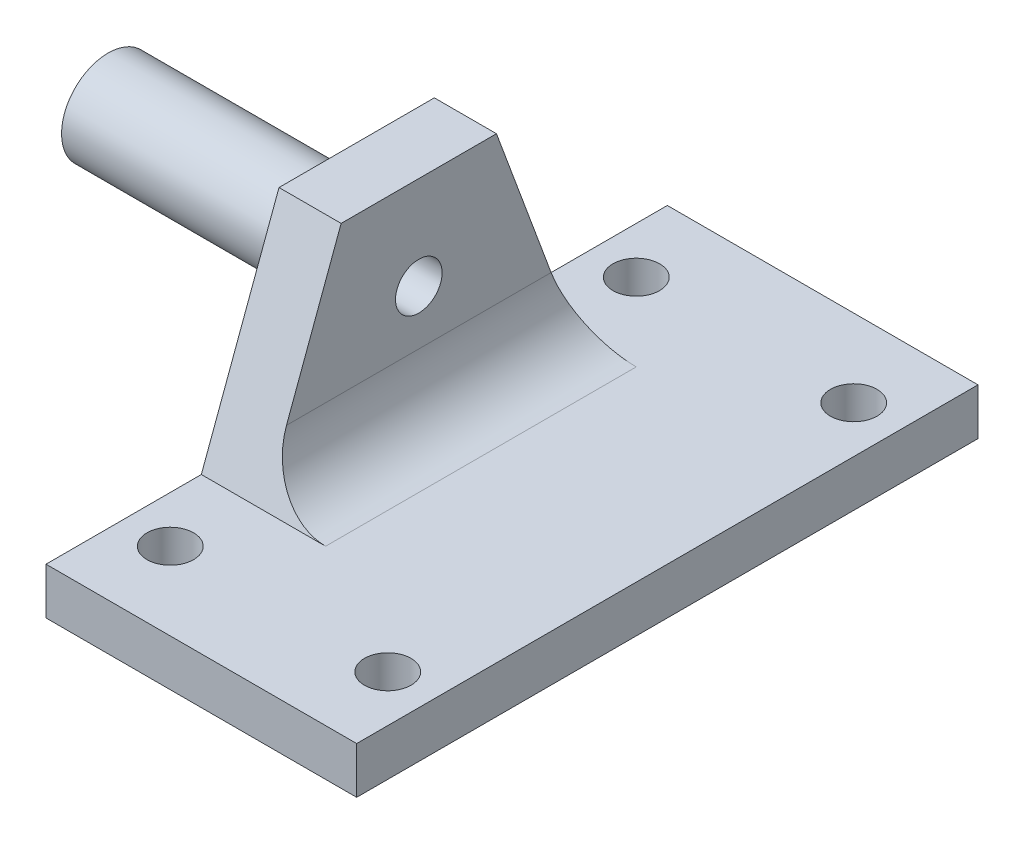
ISO-10303-21;
HEADER;
FILE_DESCRIPTION(('STEP AP214'),'2;1');
FILE_NAME('part.step','',(''),(''),'','','');
FILE_SCHEMA(('AUTOMOTIVE_DESIGN { 1 0 10303 214 1 1 1 1 }'));
ENDSEC;
DATA;
#1=APPLICATION_CONTEXT('core data for automotive mechanical design processes');
#2=APPLICATION_PROTOCOL_DEFINITION('international standard','automotive_design',2000,#1);
#3=PRODUCT_CONTEXT('',#1,'mechanical');
#4=PRODUCT('Part','Part','',(#3));
#5=PRODUCT_RELATED_PRODUCT_CATEGORY('part','',(#4));
#6=PRODUCT_DEFINITION_FORMATION('','',#4);
#7=PRODUCT_DEFINITION_CONTEXT('part definition',#1,'design');
#8=PRODUCT_DEFINITION('design','',#6,#7);
#9=PRODUCT_DEFINITION_SHAPE('','',#8);
#10=(LENGTH_UNIT() NAMED_UNIT(*) SI_UNIT(.MILLI.,.METRE.));
#11=(NAMED_UNIT(*) PLANE_ANGLE_UNIT() SI_UNIT($,.RADIAN.));
#12=(NAMED_UNIT(*) SI_UNIT($,.STERADIAN.) SOLID_ANGLE_UNIT());
#13=UNCERTAINTY_MEASURE_WITH_UNIT(LENGTH_MEASURE(1.E-05),#10,'distance_accuracy_value','');
#14=(GEOMETRIC_REPRESENTATION_CONTEXT(3) GLOBAL_UNCERTAINTY_ASSIGNED_CONTEXT((#13)) GLOBAL_UNIT_ASSIGNED_CONTEXT((#10,
#11,#12)) REPRESENTATION_CONTEXT('',''));
#15=CARTESIAN_POINT('',(0.,0.,0.));
#16=DIRECTION('',(0.,0.,1.));
#17=DIRECTION('',(1.,0.,0.));
#18=AXIS2_PLACEMENT_3D('',#15,#16,#17);
#19=CARTESIAN_POINT('',(4.,0.,0.));
#20=DIRECTION('',(1.,0.,0.));
#21=DIRECTION('',(0.,0.,-1.));
#22=AXIS2_PLACEMENT_3D('',#19,#20,#21);
#23=PLANE('',#22);
#24=CARTESIAN_POINT('',(4.,8.99999999999999,0.));
#25=DIRECTION('',(1.,0.,0.));
#26=DIRECTION('',(0.,0.,-1.));
#27=AXIS2_PLACEMENT_3D('',#24,#25,#26);
#28=CIRCLE('',#27,1.5);
#29=CARTESIAN_POINT('',(4.,8.99999999999999,-1.5));
#30=VERTEX_POINT('',#29);
#31=EDGE_CURVE('E133',#30,#30,#28,.T.);
#32=ORIENTED_EDGE('',*,*,#31,.F.);
#33=EDGE_LOOP('',(#32));
#34=FACE_BOUND('',#33,.T.);
#35=DIRECTION('',(0.,0.937748760723704,-0.347314355823594));
#36=VECTOR('',#35,1.);
#37=CARTESIAN_POINT('',(4.,3.43787696019301,9.28226779252111));
#38=LINE('',#37,#36);
#39=CARTESIAN_POINT('',(4.,5.49999999999999,8.51851851851853));
#40=VERTEX_POINT('',#39);
#41=CARTESIAN_POINT('',(4.,15.,5.));
#42=VERTEX_POINT('',#41);
#43=EDGE_CURVE('E141',#40,#42,#38,.T.);
#44=ORIENTED_EDGE('',*,*,#43,.F.);
#45=DIRECTION('',(0.,0.,-1.));
#46=VECTOR('',#45,1.);
#47=CARTESIAN_POINT('',(4.,5.49999999999999,-10.));
#48=LINE('',#47,#46);
#49=CARTESIAN_POINT('',(4.,5.49999999999999,-8.51851851851853));
#50=VERTEX_POINT('',#49);
#51=EDGE_CURVE('E176',#40,#50,#48,.T.);
#52=ORIENTED_EDGE('',*,*,#51,.T.);
#53=DIRECTION('',(0.,0.937748760723704,0.347314355823594));
#54=VECTOR('',#53,1.);
#55=CARTESIAN_POINT('',(4.,3.43787696019301,-9.28226779252111));
#56=LINE('',#55,#54);
#57=CARTESIAN_POINT('',(4.,15.,-5.));
#58=VERTEX_POINT('',#57);
#59=EDGE_CURVE('E143',#50,#58,#56,.T.);
#60=ORIENTED_EDGE('',*,*,#59,.T.);
#61=DIRECTION('',(0.,0.,-1.));
#62=VECTOR('',#61,1.);
#63=CARTESIAN_POINT('',(4.,15.,0.));
#64=LINE('',#63,#62);
#65=EDGE_CURVE('E146',#42,#58,#64,.T.);
#66=ORIENTED_EDGE('',*,*,#65,.F.);
#67=EDGE_LOOP('',(#44,#52,#60,#66));
#68=FACE_BOUND('',#67,.T.);
#69=ADVANCED_FACE('F35',(#34,#68),#23,.T.);
#70=CARTESIAN_POINT('',(4.,3.43787696019301,9.28226779252111));
#71=DIRECTION('',(0.,0.347314355823594,0.937748760723704));
#72=DIRECTION('',(0.,-0.937748760723704,0.347314355823594));
#73=AXIS2_PLACEMENT_3D('',#70,#71,#72);
#74=PLANE('',#73);
#75=DIRECTION('',(0.,0.937748760723704,-0.347314355823594));
#76=VECTOR('',#75,1.);
#77=CARTESIAN_POINT('',(0.,3.43787696019301,9.28226779252111));
#78=LINE('',#77,#76);
#79=CARTESIAN_POINT('',(0.,1.5,10.));
#80=VERTEX_POINT('',#79);
#81=CARTESIAN_POINT('',(0.,15.,5.));
#82=VERTEX_POINT('',#81);
#83=EDGE_CURVE('E140',#80,#82,#78,.T.);
#84=ORIENTED_EDGE('',*,*,#83,.F.);
#85=DIRECTION('',(-1.,0.,0.));
#86=VECTOR('',#85,1.);
#87=CARTESIAN_POINT('',(4.,1.5,10.));
#88=LINE('',#87,#86);
#89=CARTESIAN_POINT('',(8.,1.5,10.));
#90=VERTEX_POINT('',#89);
#91=EDGE_CURVE('E58',#90,#80,#88,.T.);
#92=ORIENTED_EDGE('',*,*,#91,.F.);
#93=CARTESIAN_POINT('',(8.,5.49999999999999,8.51851851851853));
#94=DIRECTION('',(0.,0.347314355823594,0.937748760723704));
#95=DIRECTION('',(0.,-0.937748760723704,0.347314355823594));
#96=AXIS2_PLACEMENT_3D('',#93,#94,#95);
#97=ELLIPSE('',#96,4.26553482930014,4.);
#98=EDGE_CURVE('E183',#90,#40,#97,.F.);
#99=ORIENTED_EDGE('',*,*,#98,.T.);
#100=ORIENTED_EDGE('',*,*,#43,.T.);
#101=DIRECTION('',(-1.,0.,0.));
#102=VECTOR('',#101,1.);
#103=CARTESIAN_POINT('',(4.,15.,5.));
#104=LINE('',#103,#102);
#105=EDGE_CURVE('E149',#42,#82,#104,.T.);
#106=ORIENTED_EDGE('',*,*,#105,.T.);
#107=EDGE_LOOP('',(#84,#92,#99,#100,#106));
#108=FACE_BOUND('',#107,.T.);
#109=ADVANCED_FACE('F200',(#108),#74,.T.);
#110=CARTESIAN_POINT('',(4.,0.,20.));
#111=DIRECTION('',(0.,0.,1.));
#112=DIRECTION('',(1.,0.,0.));
#113=AXIS2_PLACEMENT_3D('',#110,#111,#112);
#114=PLANE('',#113);
#115=DIRECTION('',(0.,1.,0.));
#116=VECTOR('',#115,1.);
#117=CARTESIAN_POINT('',(0.,0.,20.));
#118=LINE('',#117,#116);
#119=CARTESIAN_POINT('',(0.,-1.49999999999999,20.));
#120=VERTEX_POINT('',#119);
#121=CARTESIAN_POINT('',(0.,1.49999999999999,20.));
#122=VERTEX_POINT('',#121);
#123=EDGE_CURVE('E155',#120,#122,#118,.T.);
#124=ORIENTED_EDGE('',*,*,#123,.F.);
#125=DIRECTION('',(-1.,0.,0.));
#126=VECTOR('',#125,1.);
#127=CARTESIAN_POINT('',(4.,-1.49999999999999,20.));
#128=LINE('',#127,#126);
#129=CARTESIAN_POINT('',(20.,-1.49999999999999,20.));
#130=VERTEX_POINT('',#129);
#131=EDGE_CURVE('E116',#130,#120,#128,.T.);
#132=ORIENTED_EDGE('',*,*,#131,.F.);
#133=DIRECTION('',(0.,1.,0.));
#134=VECTOR('',#133,1.);
#135=CARTESIAN_POINT('',(20.,-1.49999999999999,20.));
#136=LINE('',#135,#134);
#137=CARTESIAN_POINT('',(20.,1.49999999999999,20.));
#138=VERTEX_POINT('',#137);
#139=EDGE_CURVE('E127',#130,#138,#136,.T.);
#140=ORIENTED_EDGE('',*,*,#139,.T.);
#141=DIRECTION('',(-1.,0.,0.));
#142=VECTOR('',#141,1.);
#143=CARTESIAN_POINT('',(4.,1.49999999999999,20.));
#144=LINE('',#143,#142);
#145=EDGE_CURVE('E173',#138,#122,#144,.T.);
#146=ORIENTED_EDGE('',*,*,#145,.T.);
#147=EDGE_LOOP('',(#124,#132,#140,#146));
#148=FACE_BOUND('',#147,.T.);
#149=ADVANCED_FACE('F206',(#148),#114,.T.);
#150=CARTESIAN_POINT('',(4.,-1.5,0.));
#151=DIRECTION('',(0.,1.,0.));
#152=DIRECTION('',(0.,0.,1.));
#153=AXIS2_PLACEMENT_3D('',#150,#151,#152);
#154=PLANE('',#153);
#155=CARTESIAN_POINT('',(3.,-1.50000000000001,-15.));
#156=DIRECTION('',(0.,1.,0.));
#157=DIRECTION('',(0.,0.,1.));
#158=AXIS2_PLACEMENT_3D('',#155,#156,#157);
#159=CIRCLE('',#158,1.5);
#160=CARTESIAN_POINT('',(3.,-1.50000000000001,-13.5));
#161=VERTEX_POINT('',#160);
#162=EDGE_CURVE('E409',#161,#161,#159,.T.);
#163=ORIENTED_EDGE('',*,*,#162,.T.);
#164=EDGE_LOOP('',(#163));
#165=FACE_BOUND('',#164,.T.);
#166=CARTESIAN_POINT('',(3.,-1.50000000000001,15.));
#167=DIRECTION('',(0.,1.,0.));
#168=DIRECTION('',(0.,0.,1.));
#169=AXIS2_PLACEMENT_3D('',#166,#167,#168);
#170=CIRCLE('',#169,1.5);
#171=CARTESIAN_POINT('',(3.,-1.50000000000001,16.5));
#172=VERTEX_POINT('',#171);
#173=EDGE_CURVE('E413',#172,#172,#170,.T.);
#174=ORIENTED_EDGE('',*,*,#173,.T.);
#175=EDGE_LOOP('',(#174));
#176=FACE_BOUND('',#175,.T.);
#177=CARTESIAN_POINT('',(17.,-1.50000000000001,15.));
#178=DIRECTION('',(0.,1.,0.));
#179=DIRECTION('',(0.,0.,1.));
#180=AXIS2_PLACEMENT_3D('',#177,#178,#179);
#181=CIRCLE('',#180,1.5);
#182=CARTESIAN_POINT('',(17.,-1.50000000000001,16.5));
#183=VERTEX_POINT('',#182);
#184=EDGE_CURVE('E438',#183,#183,#181,.T.);
#185=ORIENTED_EDGE('',*,*,#184,.T.);
#186=EDGE_LOOP('',(#185));
#187=FACE_BOUND('',#186,.T.);
#188=CARTESIAN_POINT('',(17.,-1.50000000000001,-15.));
#189=DIRECTION('',(0.,1.,0.));
#190=DIRECTION('',(0.,0.,1.));
#191=AXIS2_PLACEMENT_3D('',#188,#189,#190);
#192=CIRCLE('',#191,1.5);
#193=CARTESIAN_POINT('',(17.,-1.50000000000001,-13.5));
#194=VERTEX_POINT('',#193);
#195=EDGE_CURVE('E421',#194,#194,#192,.T.);
#196=ORIENTED_EDGE('',*,*,#195,.T.);
#197=EDGE_LOOP('',(#196));
#198=FACE_BOUND('',#197,.T.);
#199=DIRECTION('',(0.,0.,-1.));
#200=VECTOR('',#199,1.);
#201=CARTESIAN_POINT('',(0.,-1.5,0.));
#202=LINE('',#201,#200);
#203=CARTESIAN_POINT('',(0.,-1.50000000000001,-20.));
#204=VERTEX_POINT('',#203);
#205=EDGE_CURVE('E111',#120,#204,#202,.T.);
#206=ORIENTED_EDGE('',*,*,#205,.T.);
#207=DIRECTION('',(-1.,0.,0.));
#208=VECTOR('',#207,1.);
#209=CARTESIAN_POINT('',(4.,-1.50000000000001,-20.));
#210=LINE('',#209,#208);
#211=CARTESIAN_POINT('',(20.,-1.50000000000001,-20.));
#212=VERTEX_POINT('',#211);
#213=EDGE_CURVE('E106',#212,#204,#210,.T.);
#214=ORIENTED_EDGE('',*,*,#213,.F.);
#215=DIRECTION('',(0.,0.,1.));
#216=VECTOR('',#215,1.);
#217=CARTESIAN_POINT('',(20.,-1.50000000000001,-20.));
#218=LINE('',#217,#216);
#219=EDGE_CURVE('E109',#212,#130,#218,.T.);
#220=ORIENTED_EDGE('',*,*,#219,.T.);
#221=ORIENTED_EDGE('',*,*,#131,.T.);
#222=EDGE_LOOP('',(#206,#214,#220,#221));
#223=FACE_BOUND('',#222,.T.);
#224=ADVANCED_FACE('F108',(#165,#176,#187,#198,#223),#154,.F.);
#225=CARTESIAN_POINT('',(4.,0.,-20.));
#226=DIRECTION('',(0.,0.,1.));
#227=DIRECTION('',(1.,0.,0.));
#228=AXIS2_PLACEMENT_3D('',#225,#226,#227);
#229=PLANE('',#228);
#230=DIRECTION('',(0.,1.,0.));
#231=VECTOR('',#230,1.);
#232=CARTESIAN_POINT('',(0.,0.,-20.));
#233=LINE('',#232,#231);
#234=CARTESIAN_POINT('',(0.,1.49999999999999,-20.));
#235=VERTEX_POINT('',#234);
#236=EDGE_CURVE('E160',#204,#235,#233,.T.);
#237=ORIENTED_EDGE('',*,*,#236,.T.);
#238=DIRECTION('',(-1.,0.,0.));
#239=VECTOR('',#238,1.);
#240=CARTESIAN_POINT('',(4.,1.49999999999999,-20.));
#241=LINE('',#240,#239);
#242=CARTESIAN_POINT('',(20.,1.49999999999999,-20.));
#243=VERTEX_POINT('',#242);
#244=EDGE_CURVE('E117',#243,#235,#241,.T.);
#245=ORIENTED_EDGE('',*,*,#244,.F.);
#246=DIRECTION('',(0.,-1.,0.));
#247=VECTOR('',#246,1.);
#248=CARTESIAN_POINT('',(20.,1.49999999999999,-20.));
#249=LINE('',#248,#247);
#250=EDGE_CURVE('E124',#243,#212,#249,.T.);
#251=ORIENTED_EDGE('',*,*,#250,.T.);
#252=ORIENTED_EDGE('',*,*,#213,.T.);
#253=EDGE_LOOP('',(#237,#245,#251,#252));
#254=FACE_BOUND('',#253,.T.);
#255=ADVANCED_FACE('F129',(#254),#229,.F.);
#256=CARTESIAN_POINT('',(4.,1.49999999999999,0.));
#257=DIRECTION('',(0.,1.,0.));
#258=DIRECTION('',(0.,0.,1.));
#259=AXIS2_PLACEMENT_3D('',#256,#257,#258);
#260=PLANE('',#259);
#261=CARTESIAN_POINT('',(3.,1.49999999999999,-15.));
#262=DIRECTION('',(0.,1.,0.));
#263=DIRECTION('',(0.,0.,1.));
#264=AXIS2_PLACEMENT_3D('',#261,#262,#263);
#265=CIRCLE('',#264,1.5);
#266=CARTESIAN_POINT('',(3.,1.49999999999999,-13.5));
#267=VERTEX_POINT('',#266);
#268=EDGE_CURVE('E412',#267,#267,#265,.T.);
#269=ORIENTED_EDGE('',*,*,#268,.F.);
#270=EDGE_LOOP('',(#269));
#271=FACE_BOUND('',#270,.T.);
#272=CARTESIAN_POINT('',(3.,1.49999999999999,15.));
#273=DIRECTION('',(0.,1.,0.));
#274=DIRECTION('',(0.,0.,1.));
#275=AXIS2_PLACEMENT_3D('',#272,#273,#274);
#276=CIRCLE('',#275,1.5);
#277=CARTESIAN_POINT('',(3.,1.49999999999999,16.5));
#278=VERTEX_POINT('',#277);
#279=EDGE_CURVE('E416',#278,#278,#276,.T.);
#280=ORIENTED_EDGE('',*,*,#279,.F.);
#281=EDGE_LOOP('',(#280));
#282=FACE_BOUND('',#281,.T.);
#283=CARTESIAN_POINT('',(17.,1.49999999999999,15.));
#284=DIRECTION('',(0.,1.,0.));
#285=DIRECTION('',(0.,0.,1.));
#286=AXIS2_PLACEMENT_3D('',#283,#284,#285);
#287=CIRCLE('',#286,1.5);
#288=CARTESIAN_POINT('',(17.,1.49999999999999,16.5));
#289=VERTEX_POINT('',#288);
#290=EDGE_CURVE('E428',#289,#289,#287,.T.);
#291=ORIENTED_EDGE('',*,*,#290,.F.);
#292=EDGE_LOOP('',(#291));
#293=FACE_BOUND('',#292,.T.);
#294=CARTESIAN_POINT('',(17.,1.49999999999999,-15.));
#295=DIRECTION('',(0.,1.,0.));
#296=DIRECTION('',(0.,0.,1.));
#297=AXIS2_PLACEMENT_3D('',#294,#295,#296);
#298=CIRCLE('',#297,1.5);
#299=CARTESIAN_POINT('',(17.,1.49999999999999,-13.5));
#300=VERTEX_POINT('',#299);
#301=EDGE_CURVE('E425',#300,#300,#298,.T.);
#302=ORIENTED_EDGE('',*,*,#301,.F.);
#303=EDGE_LOOP('',(#302));
#304=FACE_BOUND('',#303,.T.);
#305=DIRECTION('',(-1.,0.,0.));
#306=VECTOR('',#305,1.);
#307=CARTESIAN_POINT('',(4.,1.49999999999999,-10.));
#308=LINE('',#307,#306);
#309=CARTESIAN_POINT('',(8.,1.49999999999999,-10.));
#310=VERTEX_POINT('',#309);
#311=CARTESIAN_POINT('',(0.,1.49999999999999,-10.));
#312=VERTEX_POINT('',#311);
#313=EDGE_CURVE('E50',#310,#312,#308,.T.);
#314=ORIENTED_EDGE('',*,*,#313,.F.);
#315=DIRECTION('',(0.,0.,-1.));
#316=VECTOR('',#315,1.);
#317=CARTESIAN_POINT('',(8.,1.49999999999999,10.));
#318=LINE('',#317,#316);
#319=EDGE_CURVE('E179',#310,#90,#318,.F.);
#320=ORIENTED_EDGE('',*,*,#319,.T.);
#321=ORIENTED_EDGE('',*,*,#91,.T.);
#322=DIRECTION('',(0.,0.,-1.));
#323=VECTOR('',#322,1.);
#324=CARTESIAN_POINT('',(0.,1.49999999999999,0.));
#325=LINE('',#324,#323);
#326=EDGE_CURVE('E152',#122,#80,#325,.T.);
#327=ORIENTED_EDGE('',*,*,#326,.F.);
#328=ORIENTED_EDGE('',*,*,#145,.F.);
#329=DIRECTION('',(0.,0.,-1.));
#330=VECTOR('',#329,1.);
#331=CARTESIAN_POINT('',(20.,1.49999999999999,20.));
#332=LINE('',#331,#330);
#333=EDGE_CURVE('E138',#138,#243,#332,.T.);
#334=ORIENTED_EDGE('',*,*,#333,.T.);
#335=ORIENTED_EDGE('',*,*,#244,.T.);
#336=EDGE_CURVE('E156',#312,#235,#325,.T.);
#337=ORIENTED_EDGE('',*,*,#336,.F.);
#338=EDGE_LOOP('',(#314,#320,#321,#327,#328,#334,#335,#337));
#339=FACE_BOUND('',#338,.T.);
#340=ADVANCED_FACE('F224',(#271,#282,#293,#304,#339),#260,.T.);
#341=CARTESIAN_POINT('',(4.,3.43787696019301,-9.28226779252111));
#342=DIRECTION('',(0.,-0.347314355823594,0.937748760723704));
#343=DIRECTION('',(0.,-0.937748760723704,-0.347314355823594));
#344=AXIS2_PLACEMENT_3D('',#341,#342,#343);
#345=PLANE('',#344);
#346=DIRECTION('',(0.,0.937748760723704,0.347314355823594));
#347=VECTOR('',#346,1.);
#348=CARTESIAN_POINT('',(0.,3.43787696019301,-9.28226779252111));
#349=LINE('',#348,#347);
#350=CARTESIAN_POINT('',(0.,15.,-5.));
#351=VERTEX_POINT('',#350);
#352=EDGE_CURVE('E162',#312,#351,#349,.T.);
#353=ORIENTED_EDGE('',*,*,#352,.T.);
#354=DIRECTION('',(-1.,0.,0.));
#355=VECTOR('',#354,1.);
#356=CARTESIAN_POINT('',(4.,15.,-5.));
#357=LINE('',#356,#355);
#358=EDGE_CURVE('E168',#58,#351,#357,.T.);
#359=ORIENTED_EDGE('',*,*,#358,.F.);
#360=ORIENTED_EDGE('',*,*,#59,.F.);
#361=CARTESIAN_POINT('',(8.,5.49999999999999,-8.51851851851853));
#362=DIRECTION('',(0.,-0.347314355823594,0.937748760723704));
#363=DIRECTION('',(0.,0.937748760723704,0.347314355823594));
#364=AXIS2_PLACEMENT_3D('',#361,#362,#363);
#365=ELLIPSE('',#364,4.26553482930014,4.);
#366=EDGE_CURVE('E181',#50,#310,#365,.T.);
#367=ORIENTED_EDGE('',*,*,#366,.T.);
#368=ORIENTED_EDGE('',*,*,#313,.T.);
#369=EDGE_LOOP('',(#353,#359,#360,#367,#368));
#370=FACE_BOUND('',#369,.T.);
#371=ADVANCED_FACE('F220',(#370),#345,.F.);
#372=CARTESIAN_POINT('',(4.,15.,0.));
#373=DIRECTION('',(0.,1.,0.));
#374=DIRECTION('',(0.,0.,1.));
#375=AXIS2_PLACEMENT_3D('',#372,#373,#374);
#376=PLANE('',#375);
#377=DIRECTION('',(0.,0.,-1.));
#378=VECTOR('',#377,1.);
#379=CARTESIAN_POINT('',(0.,15.,0.));
#380=LINE('',#379,#378);
#381=EDGE_CURVE('E144',#82,#351,#380,.T.);
#382=ORIENTED_EDGE('',*,*,#381,.F.);
#383=ORIENTED_EDGE('',*,*,#105,.F.);
#384=ORIENTED_EDGE('',*,*,#65,.T.);
#385=ORIENTED_EDGE('',*,*,#358,.T.);
#386=EDGE_LOOP('',(#382,#383,#384,#385));
#387=FACE_BOUND('',#386,.T.);
#388=ADVANCED_FACE('F216',(#387),#376,.T.);
#389=CARTESIAN_POINT('',(0.,0.,0.));
#390=DIRECTION('',(1.,0.,0.));
#391=DIRECTION('',(0.,0.,-1.));
#392=AXIS2_PLACEMENT_3D('',#389,#390,#391);
#393=PLANE('',#392);
#394=CARTESIAN_POINT('',(0.,8.99999999999999,0.));
#395=DIRECTION('',(1.,0.,0.));
#396=DIRECTION('',(0.,0.,-1.));
#397=AXIS2_PLACEMENT_3D('',#394,#395,#396);
#398=CIRCLE('',#397,5.);
#399=CARTESIAN_POINT('',(0.,8.99999999999999,-5.));
#400=VERTEX_POINT('',#399);
#401=EDGE_CURVE('E11',#400,#400,#398,.T.);
#402=ORIENTED_EDGE('',*,*,#401,.T.);
#403=EDGE_LOOP('',(#402));
#404=FACE_BOUND('',#403,.T.);
#405=ORIENTED_EDGE('',*,*,#83,.T.);
#406=ORIENTED_EDGE('',*,*,#381,.T.);
#407=ORIENTED_EDGE('',*,*,#352,.F.);
#408=ORIENTED_EDGE('',*,*,#336,.T.);
#409=ORIENTED_EDGE('',*,*,#236,.F.);
#410=ORIENTED_EDGE('',*,*,#205,.F.);
#411=ORIENTED_EDGE('',*,*,#123,.T.);
#412=ORIENTED_EDGE('',*,*,#326,.T.);
#413=EDGE_LOOP('',(#405,#406,#407,#408,#409,#410,#411,#412));
#414=FACE_BOUND('',#413,.T.);
#415=ADVANCED_FACE('F213',(#404,#414),#393,.F.);
#416=CARTESIAN_POINT('',(20.,0.,0.));
#417=DIRECTION('',(-1.,0.,0.));
#418=DIRECTION('',(0.,0.,1.));
#419=AXIS2_PLACEMENT_3D('',#416,#417,#418);
#420=PLANE('',#419);
#421=ORIENTED_EDGE('',*,*,#250,.F.);
#422=ORIENTED_EDGE('',*,*,#333,.F.);
#423=ORIENTED_EDGE('',*,*,#139,.F.);
#424=ORIENTED_EDGE('',*,*,#219,.F.);
#425=EDGE_LOOP('',(#421,#422,#423,#424));
#426=FACE_BOUND('',#425,.T.);
#427=ADVANCED_FACE('F122',(#426),#420,.F.);
#428=CARTESIAN_POINT('',(-16.,8.99999999999999,0.));
#429=DIRECTION('',(1.,0.,0.));
#430=DIRECTION('',(0.,0.,-1.));
#431=AXIS2_PLACEMENT_3D('',#428,#429,#430);
#432=CYLINDRICAL_SURFACE('',#431,3.);
#433=CARTESIAN_POINT('',(-2.,8.99999999999999,0.));
#434=DIRECTION('',(1.,0.,0.));
#435=DIRECTION('',(0.,0.,-1.));
#436=AXIS2_PLACEMENT_3D('',#433,#434,#435);
#437=CIRCLE('',#436,3.);
#438=CARTESIAN_POINT('',(-2.,8.99999999999999,-3.));
#439=VERTEX_POINT('',#438);
#440=EDGE_CURVE('E43',#439,#439,#437,.F.);
#441=ORIENTED_EDGE('',*,*,#440,.T.);
#442=EDGE_LOOP('',(#441));
#443=FACE_BOUND('',#442,.T.);
#444=CARTESIAN_POINT('',(-16.,8.99999999999999,0.));
#445=DIRECTION('',(-1.,0.,0.));
#446=DIRECTION('',(0.,0.,1.));
#447=AXIS2_PLACEMENT_3D('',#444,#445,#446);
#448=CIRCLE('',#447,3.);
#449=CARTESIAN_POINT('',(-16.,8.99999999999999,3.));
#450=VERTEX_POINT('',#449);
#451=EDGE_CURVE('E130',#450,#450,#448,.T.);
#452=ORIENTED_EDGE('',*,*,#451,.F.);
#453=EDGE_LOOP('',(#452));
#454=FACE_BOUND('',#453,.T.);
#455=ADVANCED_FACE('F187',(#443,#454),#432,.T.);
#456=CARTESIAN_POINT('',(-16.,8.99999999999999,0.));
#457=DIRECTION('',(-1.,0.,0.));
#458=DIRECTION('',(0.,0.,1.));
#459=AXIS2_PLACEMENT_3D('',#456,#457,#458);
#460=PLANE('',#459);
#461=CARTESIAN_POINT('',(-16.,8.99999999999999,0.));
#462=DIRECTION('',(-1.,0.,0.));
#463=DIRECTION('',(0.,0.,1.));
#464=AXIS2_PLACEMENT_3D('',#461,#462,#463);
#465=CIRCLE('',#464,1.5);
#466=CARTESIAN_POINT('',(-16.,8.99999999999999,1.5));
#467=VERTEX_POINT('',#466);
#468=EDGE_CURVE('E424',#467,#467,#465,.T.);
#469=ORIENTED_EDGE('',*,*,#468,.F.);
#470=EDGE_LOOP('',(#469));
#471=FACE_BOUND('',#470,.T.);
#472=ORIENTED_EDGE('',*,*,#451,.T.);
#473=EDGE_LOOP('',(#472));
#474=FACE_BOUND('',#473,.T.);
#475=ADVANCED_FACE('F293',(#471,#474),#460,.T.);
#476=CARTESIAN_POINT('',(20.,8.99999999999999,0.));
#477=DIRECTION('',(-1.,0.,0.));
#478=DIRECTION('',(0.,0.,1.));
#479=AXIS2_PLACEMENT_3D('',#476,#477,#478);
#480=CYLINDRICAL_SURFACE('',#479,1.5);
#481=ORIENTED_EDGE('',*,*,#31,.T.);
#482=EDGE_LOOP('',(#481));
#483=FACE_BOUND('',#482,.T.);
#484=ORIENTED_EDGE('',*,*,#468,.T.);
#485=EDGE_LOOP('',(#484));
#486=FACE_BOUND('',#485,.T.);
#487=ADVANCED_FACE('F298',(#483,#486),#480,.F.);
#488=CARTESIAN_POINT('',(17.,-1.50000000000001,-15.));
#489=DIRECTION('',(0.,1.,0.));
#490=DIRECTION('',(0.,0.,1.));
#491=AXIS2_PLACEMENT_3D('',#488,#489,#490);
#492=CYLINDRICAL_SURFACE('',#491,1.5);
#493=ORIENTED_EDGE('',*,*,#195,.F.);
#494=EDGE_LOOP('',(#493));
#495=FACE_BOUND('',#494,.T.);
#496=ORIENTED_EDGE('',*,*,#301,.T.);
#497=EDGE_LOOP('',(#496));
#498=FACE_BOUND('',#497,.T.);
#499=ADVANCED_FACE('F305',(#495,#498),#492,.F.);
#500=CARTESIAN_POINT('',(17.,-1.50000000000001,15.));
#501=DIRECTION('',(0.,1.,0.));
#502=DIRECTION('',(0.,0.,1.));
#503=AXIS2_PLACEMENT_3D('',#500,#501,#502);
#504=CYLINDRICAL_SURFACE('',#503,1.5);
#505=ORIENTED_EDGE('',*,*,#184,.F.);
#506=EDGE_LOOP('',(#505));
#507=FACE_BOUND('',#506,.T.);
#508=ORIENTED_EDGE('',*,*,#290,.T.);
#509=EDGE_LOOP('',(#508));
#510=FACE_BOUND('',#509,.T.);
#511=ADVANCED_FACE('F312',(#507,#510),#504,.F.);
#512=CARTESIAN_POINT('',(3.,-1.50000000000001,15.));
#513=DIRECTION('',(0.,1.,0.));
#514=DIRECTION('',(0.,0.,1.));
#515=AXIS2_PLACEMENT_3D('',#512,#513,#514);
#516=CYLINDRICAL_SURFACE('',#515,1.5);
#517=ORIENTED_EDGE('',*,*,#173,.F.);
#518=EDGE_LOOP('',(#517));
#519=FACE_BOUND('',#518,.T.);
#520=ORIENTED_EDGE('',*,*,#279,.T.);
#521=EDGE_LOOP('',(#520));
#522=FACE_BOUND('',#521,.T.);
#523=ADVANCED_FACE('F320',(#519,#522),#516,.F.);
#524=CARTESIAN_POINT('',(3.,-1.50000000000001,-15.));
#525=DIRECTION('',(0.,1.,0.));
#526=DIRECTION('',(0.,0.,1.));
#527=AXIS2_PLACEMENT_3D('',#524,#525,#526);
#528=CYLINDRICAL_SURFACE('',#527,1.5);
#529=ORIENTED_EDGE('',*,*,#162,.F.);
#530=EDGE_LOOP('',(#529));
#531=FACE_BOUND('',#530,.T.);
#532=ORIENTED_EDGE('',*,*,#268,.T.);
#533=EDGE_LOOP('',(#532));
#534=FACE_BOUND('',#533,.T.);
#535=ADVANCED_FACE('F196',(#531,#534),#528,.F.);
#536=CARTESIAN_POINT('',(8.,5.49999999999999,0.));
#537=DIRECTION('',(0.,0.,1.));
#538=DIRECTION('',(1.,0.,0.));
#539=AXIS2_PLACEMENT_3D('',#536,#537,#538);
#540=CYLINDRICAL_SURFACE('',#539,4.);
#541=ORIENTED_EDGE('',*,*,#98,.F.);
#542=ORIENTED_EDGE('',*,*,#319,.F.);
#543=ORIENTED_EDGE('',*,*,#366,.F.);
#544=ORIENTED_EDGE('',*,*,#51,.F.);
#545=EDGE_LOOP('',(#541,#542,#543,#544));
#546=FACE_BOUND('',#545,.T.);
#547=ADVANCED_FACE('F191',(#546),#540,.F.);
#548=CARTESIAN_POINT('',(-2.,8.99999999999999,0.));
#549=DIRECTION('',(1.,0.,0.));
#550=DIRECTION('',(0.,0.,-1.));
#551=AXIS2_PLACEMENT_3D('',#548,#549,#550);
#552=TOROIDAL_SURFACE('',#551,5.,2.);
#553=ORIENTED_EDGE('',*,*,#401,.F.);
#554=EDGE_LOOP('',(#553));
#555=FACE_BOUND('',#554,.T.);
#556=ORIENTED_EDGE('',*,*,#440,.F.);
#557=EDGE_LOOP('',(#556));
#558=FACE_BOUND('',#557,.T.);
#559=ADVANCED_FACE('F37',(#555,#558),#552,.F.);
#560=CLOSED_SHELL('',(#69,#109,#149,#224,#255,#340,#371,#388,#415,#427,#455,#475,#487,#499,#511,
#523,#535,#547,#559));
#561=MANIFOLD_SOLID_BREP('B2',#560);
#562=ADVANCED_BREP_SHAPE_REPRESENTATION('',(#18,#561),#14);
#563=SHAPE_DEFINITION_REPRESENTATION(#9,#562);
ENDSEC;
END-ISO-10303-21;
